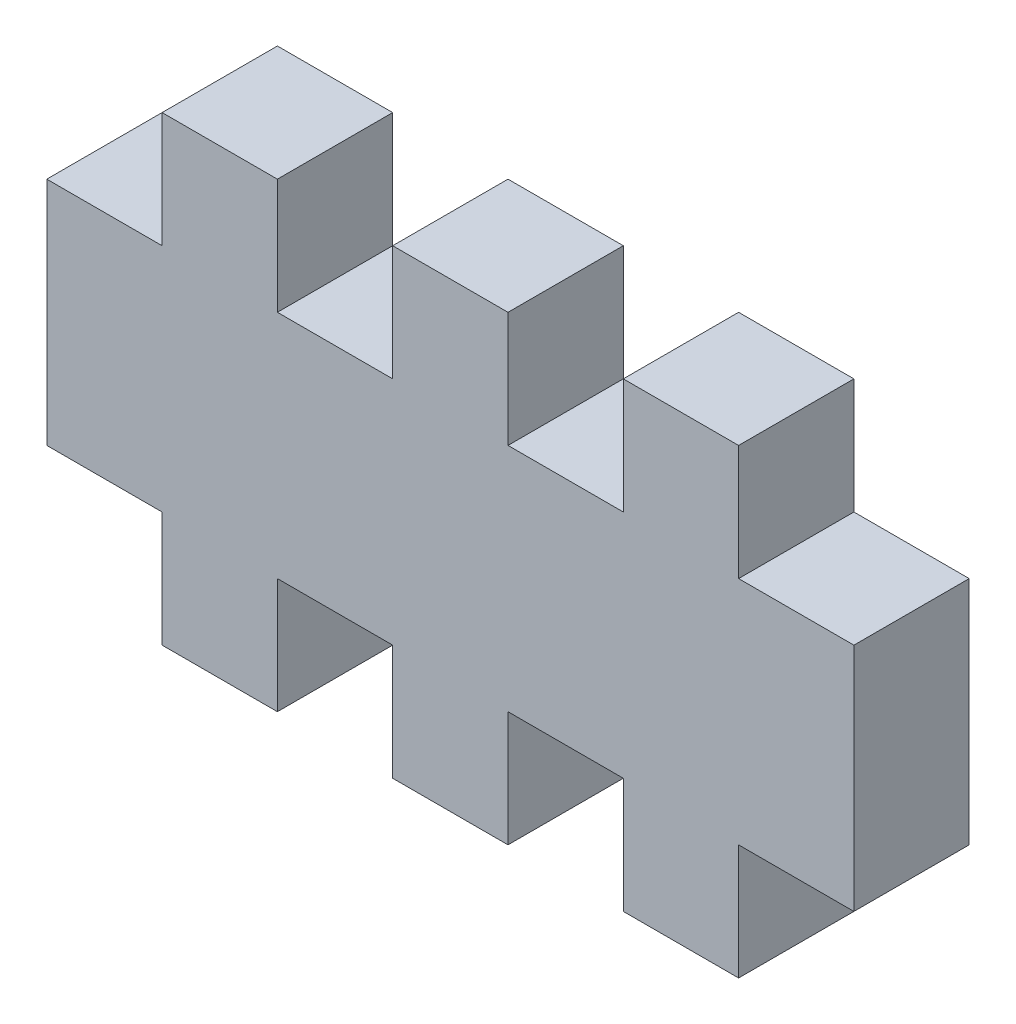
ISO-10303-21;
HEADER;
FILE_DESCRIPTION(('STEP AP214'),'2;1');
FILE_NAME('part.step','',(''),(''),'','','');
FILE_SCHEMA(('AUTOMOTIVE_DESIGN { 1 0 10303 214 1 1 1 1 }'));
ENDSEC;
DATA;
#1=APPLICATION_CONTEXT('core data for automotive mechanical design processes');
#2=APPLICATION_PROTOCOL_DEFINITION('international standard','automotive_design',2000,#1);
#3=PRODUCT_CONTEXT('',#1,'mechanical');
#4=PRODUCT('Part','Part','',(#3));
#5=PRODUCT_RELATED_PRODUCT_CATEGORY('part','',(#4));
#6=PRODUCT_DEFINITION_FORMATION('','',#4);
#7=PRODUCT_DEFINITION_CONTEXT('part definition',#1,'design');
#8=PRODUCT_DEFINITION('design','',#6,#7);
#9=PRODUCT_DEFINITION_SHAPE('','',#8);
#10=(LENGTH_UNIT() NAMED_UNIT(*) SI_UNIT(.MILLI.,.METRE.));
#11=(NAMED_UNIT(*) PLANE_ANGLE_UNIT() SI_UNIT($,.RADIAN.));
#12=(NAMED_UNIT(*) SI_UNIT($,.STERADIAN.) SOLID_ANGLE_UNIT());
#13=UNCERTAINTY_MEASURE_WITH_UNIT(LENGTH_MEASURE(1.E-05),#10,'distance_accuracy_value','');
#14=(GEOMETRIC_REPRESENTATION_CONTEXT(3) GLOBAL_UNCERTAINTY_ASSIGNED_CONTEXT((#13)) GLOBAL_UNIT_ASSIGNED_CONTEXT((#10,
#11,#12)) REPRESENTATION_CONTEXT('',''));
#15=CARTESIAN_POINT('',(0.,0.,0.));
#16=DIRECTION('',(0.,0.,1.));
#17=DIRECTION('',(1.,0.,0.));
#18=AXIS2_PLACEMENT_3D('',#15,#16,#17);
#19=CARTESIAN_POINT('',(6.,0.,3.));
#20=DIRECTION('',(1.,0.,0.));
#21=DIRECTION('',(0.,0.,-1.));
#22=AXIS2_PLACEMENT_3D('',#19,#20,#21);
#23=PLANE('',#22);
#24=DIRECTION('',(0.,-1.,0.));
#25=VECTOR('',#24,1.);
#26=CARTESIAN_POINT('',(6.,0.,0.));
#27=LINE('',#26,#25);
#28=CARTESIAN_POINT('',(6.,0.,0.));
#29=VERTEX_POINT('',#28);
#30=CARTESIAN_POINT('',(6.,-3.00000000000001,0.));
#31=VERTEX_POINT('',#30);
#32=EDGE_CURVE('E251',#29,#31,#27,.T.);
#33=ORIENTED_EDGE('',*,*,#32,.F.);
#34=DIRECTION('',(0.,0.,-1.));
#35=VECTOR('',#34,1.);
#36=CARTESIAN_POINT('',(6.,0.,3.));
#37=LINE('',#36,#35);
#38=CARTESIAN_POINT('',(6.,0.,3.));
#39=VERTEX_POINT('',#38);
#40=EDGE_CURVE('E11',#39,#29,#37,.T.);
#41=ORIENTED_EDGE('',*,*,#40,.F.);
#42=DIRECTION('',(0.,-1.,0.));
#43=VECTOR('',#42,1.);
#44=CARTESIAN_POINT('',(6.,0.,3.));
#45=LINE('',#44,#43);
#46=CARTESIAN_POINT('',(6.,-3.00000000000001,3.));
#47=VERTEX_POINT('',#46);
#48=EDGE_CURVE('E316',#39,#47,#45,.T.);
#49=ORIENTED_EDGE('',*,*,#48,.T.);
#50=DIRECTION('',(0.,0.,-1.));
#51=VECTOR('',#50,1.);
#52=CARTESIAN_POINT('',(6.,-3.00000000000001,3.));
#53=LINE('',#52,#51);
#54=EDGE_CURVE('E146',#47,#31,#53,.T.);
#55=ORIENTED_EDGE('',*,*,#54,.T.);
#56=EDGE_LOOP('',(#33,#41,#49,#55));
#57=FACE_BOUND('',#56,.T.);
#58=ADVANCED_FACE('F35',(#57),#23,.T.);
#59=CARTESIAN_POINT('',(0.,0.,3.));
#60=DIRECTION('',(0.,1.,0.));
#61=DIRECTION('',(0.,0.,1.));
#62=AXIS2_PLACEMENT_3D('',#59,#60,#61);
#63=PLANE('',#62);
#64=DIRECTION('',(1.,0.,0.));
#65=VECTOR('',#64,1.);
#66=CARTESIAN_POINT('',(0.,0.,0.));
#67=LINE('',#66,#65);
#68=CARTESIAN_POINT('',(8.99999999999999,0.,0.));
#69=VERTEX_POINT('',#68);
#70=EDGE_CURVE('E254',#29,#69,#67,.T.);
#71=ORIENTED_EDGE('',*,*,#70,.T.);
#72=DIRECTION('',(0.,0.,-1.));
#73=VECTOR('',#72,1.);
#74=CARTESIAN_POINT('',(8.99999999999999,0.,3.));
#75=LINE('',#74,#73);
#76=CARTESIAN_POINT('',(8.99999999999999,0.,3.));
#77=VERTEX_POINT('',#76);
#78=EDGE_CURVE('E43',#77,#69,#75,.T.);
#79=ORIENTED_EDGE('',*,*,#78,.F.);
#80=DIRECTION('',(1.,0.,0.));
#81=VECTOR('',#80,1.);
#82=CARTESIAN_POINT('',(0.,0.,3.));
#83=LINE('',#82,#81);
#84=EDGE_CURVE('E237',#39,#77,#83,.T.);
#85=ORIENTED_EDGE('',*,*,#84,.F.);
#86=ORIENTED_EDGE('',*,*,#40,.T.);
#87=EDGE_LOOP('',(#71,#79,#85,#86));
#88=FACE_BOUND('',#87,.T.);
#89=ADVANCED_FACE('F492',(#88),#63,.F.);
#90=CARTESIAN_POINT('',(8.99999999999999,0.,3.));
#91=DIRECTION('',(1.,0.,0.));
#92=DIRECTION('',(0.,0.,-1.));
#93=AXIS2_PLACEMENT_3D('',#90,#91,#92);
#94=PLANE('',#93);
#95=DIRECTION('',(0.,-1.,0.));
#96=VECTOR('',#95,1.);
#97=CARTESIAN_POINT('',(8.99999999999999,0.,0.));
#98=LINE('',#97,#96);
#99=CARTESIAN_POINT('',(8.99999999999999,-3.00000000000001,0.));
#100=VERTEX_POINT('',#99);
#101=EDGE_CURVE('E256',#69,#100,#98,.T.);
#102=ORIENTED_EDGE('',*,*,#101,.T.);
#103=DIRECTION('',(0.,0.,-1.));
#104=VECTOR('',#103,1.);
#105=CARTESIAN_POINT('',(8.99999999999999,-3.00000000000001,3.));
#106=LINE('',#105,#104);
#107=CARTESIAN_POINT('',(8.99999999999999,-3.00000000000001,3.));
#108=VERTEX_POINT('',#107);
#109=EDGE_CURVE('E365',#108,#100,#106,.T.);
#110=ORIENTED_EDGE('',*,*,#109,.F.);
#111=DIRECTION('',(0.,-1.,0.));
#112=VECTOR('',#111,1.);
#113=CARTESIAN_POINT('',(8.99999999999999,0.,3.));
#114=LINE('',#113,#112);
#115=EDGE_CURVE('E374',#77,#108,#114,.T.);
#116=ORIENTED_EDGE('',*,*,#115,.F.);
#117=ORIENTED_EDGE('',*,*,#78,.T.);
#118=EDGE_LOOP('',(#102,#110,#116,#117));
#119=FACE_BOUND('',#118,.T.);
#120=ADVANCED_FACE('F372',(#119),#94,.F.);
#121=CARTESIAN_POINT('',(0.,-3.00000000000001,3.));
#122=DIRECTION('',(0.,1.,0.));
#123=DIRECTION('',(0.,0.,1.));
#124=AXIS2_PLACEMENT_3D('',#121,#122,#123);
#125=PLANE('',#124);
#126=DIRECTION('',(1.,0.,0.));
#127=VECTOR('',#126,1.);
#128=CARTESIAN_POINT('',(0.,-3.00000000000001,0.));
#129=LINE('',#128,#127);
#130=CARTESIAN_POINT('',(12.,-3.00000000000001,0.));
#131=VERTEX_POINT('',#130);
#132=EDGE_CURVE('E259',#100,#131,#129,.T.);
#133=ORIENTED_EDGE('',*,*,#132,.T.);
#134=DIRECTION('',(0.,0.,-1.));
#135=VECTOR('',#134,1.);
#136=CARTESIAN_POINT('',(12.,-3.00000000000001,3.));
#137=LINE('',#136,#135);
#138=CARTESIAN_POINT('',(12.,-3.00000000000001,3.));
#139=VERTEX_POINT('',#138);
#140=EDGE_CURVE('E363',#139,#131,#137,.T.);
#141=ORIENTED_EDGE('',*,*,#140,.F.);
#142=DIRECTION('',(1.,0.,0.));
#143=VECTOR('',#142,1.);
#144=CARTESIAN_POINT('',(0.,-3.00000000000001,3.));
#145=LINE('',#144,#143);
#146=EDGE_CURVE('E387',#108,#139,#145,.T.);
#147=ORIENTED_EDGE('',*,*,#146,.F.);
#148=ORIENTED_EDGE('',*,*,#109,.T.);
#149=EDGE_LOOP('',(#133,#141,#147,#148));
#150=FACE_BOUND('',#149,.T.);
#151=ADVANCED_FACE('F384',(#150),#125,.F.);
#152=CARTESIAN_POINT('',(12.,0.,3.));
#153=DIRECTION('',(1.,0.,0.));
#154=DIRECTION('',(0.,0.,-1.));
#155=AXIS2_PLACEMENT_3D('',#152,#153,#154);
#156=PLANE('',#155);
#157=DIRECTION('',(0.,-1.,0.));
#158=VECTOR('',#157,1.);
#159=CARTESIAN_POINT('',(12.,0.,0.));
#160=LINE('',#159,#158);
#161=CARTESIAN_POINT('',(12.,0.,0.));
#162=VERTEX_POINT('',#161);
#163=EDGE_CURVE('E262',#162,#131,#160,.T.);
#164=ORIENTED_EDGE('',*,*,#163,.F.);
#165=DIRECTION('',(0.,0.,-1.));
#166=VECTOR('',#165,1.);
#167=CARTESIAN_POINT('',(12.,0.,3.));
#168=LINE('',#167,#166);
#169=CARTESIAN_POINT('',(12.,0.,3.));
#170=VERTEX_POINT('',#169);
#171=EDGE_CURVE('E361',#170,#162,#168,.T.);
#172=ORIENTED_EDGE('',*,*,#171,.F.);
#173=DIRECTION('',(0.,-1.,0.));
#174=VECTOR('',#173,1.);
#175=CARTESIAN_POINT('',(12.,0.,3.));
#176=LINE('',#175,#174);
#177=EDGE_CURVE('E389',#170,#139,#176,.T.);
#178=ORIENTED_EDGE('',*,*,#177,.T.);
#179=ORIENTED_EDGE('',*,*,#140,.T.);
#180=EDGE_LOOP('',(#164,#172,#178,#179));
#181=FACE_BOUND('',#180,.T.);
#182=ADVANCED_FACE('F540',(#181),#156,.T.);
#183=CARTESIAN_POINT('',(15.,0.,0.));
#184=VERTEX_POINT('',#183);
#185=EDGE_CURVE('E257',#162,#184,#67,.T.);
#186=ORIENTED_EDGE('',*,*,#185,.T.);
#187=DIRECTION('',(0.,0.,-1.));
#188=VECTOR('',#187,1.);
#189=CARTESIAN_POINT('',(15.,0.,3.));
#190=LINE('',#189,#188);
#191=CARTESIAN_POINT('',(15.,0.,3.));
#192=VERTEX_POINT('',#191);
#193=EDGE_CURVE('E358',#192,#184,#190,.T.);
#194=ORIENTED_EDGE('',*,*,#193,.F.);
#195=EDGE_CURVE('E391',#170,#192,#83,.T.);
#196=ORIENTED_EDGE('',*,*,#195,.F.);
#197=ORIENTED_EDGE('',*,*,#171,.T.);
#198=EDGE_LOOP('',(#186,#194,#196,#197));
#199=FACE_BOUND('',#198,.T.);
#200=ADVANCED_FACE('F497',(#199),#63,.F.);
#201=CARTESIAN_POINT('',(15.,0.,3.));
#202=DIRECTION('',(1.,0.,0.));
#203=DIRECTION('',(0.,0.,-1.));
#204=AXIS2_PLACEMENT_3D('',#201,#202,#203);
#205=PLANE('',#204);
#206=DIRECTION('',(0.,-1.,0.));
#207=VECTOR('',#206,1.);
#208=CARTESIAN_POINT('',(15.,0.,0.));
#209=LINE('',#208,#207);
#210=CARTESIAN_POINT('',(15.,-3.00000000000001,0.));
#211=VERTEX_POINT('',#210);
#212=EDGE_CURVE('E265',#184,#211,#209,.T.);
#213=ORIENTED_EDGE('',*,*,#212,.T.);
#214=DIRECTION('',(0.,0.,-1.));
#215=VECTOR('',#214,1.);
#216=CARTESIAN_POINT('',(15.,-3.00000000000001,3.));
#217=LINE('',#216,#215);
#218=CARTESIAN_POINT('',(15.,-3.00000000000001,3.));
#219=VERTEX_POINT('',#218);
#220=EDGE_CURVE('E355',#219,#211,#217,.T.);
#221=ORIENTED_EDGE('',*,*,#220,.F.);
#222=DIRECTION('',(0.,-1.,0.));
#223=VECTOR('',#222,1.);
#224=CARTESIAN_POINT('',(15.,0.,3.));
#225=LINE('',#224,#223);
#226=EDGE_CURVE('E395',#192,#219,#225,.T.);
#227=ORIENTED_EDGE('',*,*,#226,.F.);
#228=ORIENTED_EDGE('',*,*,#193,.T.);
#229=EDGE_LOOP('',(#213,#221,#227,#228));
#230=FACE_BOUND('',#229,.T.);
#231=ADVANCED_FACE('F536',(#230),#205,.F.);
#232=CARTESIAN_POINT('',(0.,-3.00000000000001,3.));
#233=DIRECTION('',(0.,1.,0.));
#234=DIRECTION('',(0.,0.,1.));
#235=AXIS2_PLACEMENT_3D('',#232,#233,#234);
#236=PLANE('',#235);
#237=DIRECTION('',(1.,0.,0.));
#238=VECTOR('',#237,1.);
#239=CARTESIAN_POINT('',(0.,-3.00000000000001,0.));
#240=LINE('',#239,#238);
#241=CARTESIAN_POINT('',(18.,-3.00000000000001,0.));
#242=VERTEX_POINT('',#241);
#243=EDGE_CURVE('E267',#211,#242,#240,.T.);
#244=ORIENTED_EDGE('',*,*,#243,.T.);
#245=DIRECTION('',(0.,0.,-1.));
#246=VECTOR('',#245,1.);
#247=CARTESIAN_POINT('',(18.,-3.00000000000001,3.));
#248=LINE('',#247,#246);
#249=CARTESIAN_POINT('',(18.,-3.00000000000001,3.));
#250=VERTEX_POINT('',#249);
#251=EDGE_CURVE('E353',#250,#242,#248,.T.);
#252=ORIENTED_EDGE('',*,*,#251,.F.);
#253=DIRECTION('',(1.,0.,0.));
#254=VECTOR('',#253,1.);
#255=CARTESIAN_POINT('',(0.,-3.00000000000001,3.));
#256=LINE('',#255,#254);
#257=EDGE_CURVE('E397',#219,#250,#256,.T.);
#258=ORIENTED_EDGE('',*,*,#257,.F.);
#259=ORIENTED_EDGE('',*,*,#220,.T.);
#260=EDGE_LOOP('',(#244,#252,#258,#259));
#261=FACE_BOUND('',#260,.T.);
#262=ADVANCED_FACE('F532',(#261),#236,.F.);
#263=CARTESIAN_POINT('',(18.,0.,3.));
#264=DIRECTION('',(1.,0.,0.));
#265=DIRECTION('',(0.,0.,-1.));
#266=AXIS2_PLACEMENT_3D('',#263,#264,#265);
#267=PLANE('',#266);
#268=DIRECTION('',(0.,-1.,0.));
#269=VECTOR('',#268,1.);
#270=CARTESIAN_POINT('',(18.,0.,0.));
#271=LINE('',#270,#269);
#272=CARTESIAN_POINT('',(18.,0.,0.));
#273=VERTEX_POINT('',#272);
#274=EDGE_CURVE('E270',#273,#242,#271,.T.);
#275=ORIENTED_EDGE('',*,*,#274,.F.);
#276=DIRECTION('',(0.,0.,-1.));
#277=VECTOR('',#276,1.);
#278=CARTESIAN_POINT('',(18.,0.,3.));
#279=LINE('',#278,#277);
#280=CARTESIAN_POINT('',(18.,0.,3.));
#281=VERTEX_POINT('',#280);
#282=EDGE_CURVE('E351',#281,#273,#279,.T.);
#283=ORIENTED_EDGE('',*,*,#282,.F.);
#284=DIRECTION('',(0.,-1.,0.));
#285=VECTOR('',#284,1.);
#286=CARTESIAN_POINT('',(18.,0.,3.));
#287=LINE('',#286,#285);
#288=EDGE_CURVE('E399',#281,#250,#287,.T.);
#289=ORIENTED_EDGE('',*,*,#288,.T.);
#290=ORIENTED_EDGE('',*,*,#251,.T.);
#291=EDGE_LOOP('',(#275,#283,#289,#290));
#292=FACE_BOUND('',#291,.T.);
#293=ADVANCED_FACE('F528',(#292),#267,.T.);
#294=CARTESIAN_POINT('',(21.,0.,0.));
#295=VERTEX_POINT('',#294);
#296=EDGE_CURVE('E273',#273,#295,#67,.T.);
#297=ORIENTED_EDGE('',*,*,#296,.T.);
#298=DIRECTION('',(0.,0.,-1.));
#299=VECTOR('',#298,1.);
#300=CARTESIAN_POINT('',(21.,0.,3.));
#301=LINE('',#300,#299);
#302=CARTESIAN_POINT('',(21.,0.,3.));
#303=VERTEX_POINT('',#302);
#304=EDGE_CURVE('E348',#303,#295,#301,.T.);
#305=ORIENTED_EDGE('',*,*,#304,.F.);
#306=EDGE_CURVE('E236',#281,#303,#83,.T.);
#307=ORIENTED_EDGE('',*,*,#306,.F.);
#308=ORIENTED_EDGE('',*,*,#282,.T.);
#309=EDGE_LOOP('',(#297,#305,#307,#308));
#310=FACE_BOUND('',#309,.T.);
#311=ADVANCED_FACE('F511',(#310),#63,.F.);
#312=CARTESIAN_POINT('',(21.,0.,3.));
#313=DIRECTION('',(-1.,0.,0.));
#314=DIRECTION('',(0.,0.,1.));
#315=AXIS2_PLACEMENT_3D('',#312,#313,#314);
#316=PLANE('',#315);
#317=DIRECTION('',(0.,1.,0.));
#318=VECTOR('',#317,1.);
#319=CARTESIAN_POINT('',(21.,0.,0.));
#320=LINE('',#319,#318);
#321=CARTESIAN_POINT('',(21.,6.,0.));
#322=VERTEX_POINT('',#321);
#323=EDGE_CURVE('E274',#295,#322,#320,.T.);
#324=ORIENTED_EDGE('',*,*,#323,.T.);
#325=DIRECTION('',(0.,0.,-1.));
#326=VECTOR('',#325,1.);
#327=CARTESIAN_POINT('',(21.,6.,3.));
#328=LINE('',#327,#326);
#329=CARTESIAN_POINT('',(21.,6.,3.));
#330=VERTEX_POINT('',#329);
#331=EDGE_CURVE('E346',#330,#322,#328,.T.);
#332=ORIENTED_EDGE('',*,*,#331,.F.);
#333=DIRECTION('',(0.,1.,0.));
#334=VECTOR('',#333,1.);
#335=CARTESIAN_POINT('',(21.,0.,3.));
#336=LINE('',#335,#334);
#337=EDGE_CURVE('E402',#303,#330,#336,.T.);
#338=ORIENTED_EDGE('',*,*,#337,.F.);
#339=ORIENTED_EDGE('',*,*,#304,.T.);
#340=EDGE_LOOP('',(#324,#332,#338,#339));
#341=FACE_BOUND('',#340,.T.);
#342=ADVANCED_FACE('F515',(#341),#316,.F.);
#343=CARTESIAN_POINT('',(0.,6.,3.));
#344=DIRECTION('',(0.,1.,0.));
#345=DIRECTION('',(0.,0.,1.));
#346=AXIS2_PLACEMENT_3D('',#343,#344,#345);
#347=PLANE('',#346);
#348=DIRECTION('',(1.,0.,0.));
#349=VECTOR('',#348,1.);
#350=CARTESIAN_POINT('',(0.,6.,0.));
#351=LINE('',#350,#349);
#352=CARTESIAN_POINT('',(18.,6.,0.));
#353=VERTEX_POINT('',#352);
#354=EDGE_CURVE('E277',#353,#322,#351,.T.);
#355=ORIENTED_EDGE('',*,*,#354,.F.);
#356=DIRECTION('',(0.,0.,-1.));
#357=VECTOR('',#356,1.);
#358=CARTESIAN_POINT('',(18.,6.,3.));
#359=LINE('',#358,#357);
#360=CARTESIAN_POINT('',(18.,6.,3.));
#361=VERTEX_POINT('',#360);
#362=EDGE_CURVE('E344',#361,#353,#359,.T.);
#363=ORIENTED_EDGE('',*,*,#362,.F.);
#364=DIRECTION('',(1.,0.,0.));
#365=VECTOR('',#364,1.);
#366=CARTESIAN_POINT('',(0.,6.,3.));
#367=LINE('',#366,#365);
#368=EDGE_CURVE('E404',#361,#330,#367,.T.);
#369=ORIENTED_EDGE('',*,*,#368,.T.);
#370=ORIENTED_EDGE('',*,*,#331,.T.);
#371=EDGE_LOOP('',(#355,#363,#369,#370));
#372=FACE_BOUND('',#371,.T.);
#373=ADVANCED_FACE('F489',(#372),#347,.T.);
#374=CARTESIAN_POINT('',(18.,0.,3.));
#375=DIRECTION('',(-1.,0.,0.));
#376=DIRECTION('',(0.,0.,1.));
#377=AXIS2_PLACEMENT_3D('',#374,#375,#376);
#378=PLANE('',#377);
#379=DIRECTION('',(0.,1.,0.));
#380=VECTOR('',#379,1.);
#381=CARTESIAN_POINT('',(18.,0.,0.));
#382=LINE('',#381,#380);
#383=CARTESIAN_POINT('',(18.,9.,0.));
#384=VERTEX_POINT('',#383);
#385=EDGE_CURVE('E280',#353,#384,#382,.T.);
#386=ORIENTED_EDGE('',*,*,#385,.T.);
#387=DIRECTION('',(0.,0.,-1.));
#388=VECTOR('',#387,1.);
#389=CARTESIAN_POINT('',(18.,9.,3.));
#390=LINE('',#389,#388);
#391=CARTESIAN_POINT('',(18.,9.,3.));
#392=VERTEX_POINT('',#391);
#393=EDGE_CURVE('E342',#392,#384,#390,.T.);
#394=ORIENTED_EDGE('',*,*,#393,.F.);
#395=DIRECTION('',(0.,1.,0.));
#396=VECTOR('',#395,1.);
#397=CARTESIAN_POINT('',(18.,0.,3.));
#398=LINE('',#397,#396);
#399=EDGE_CURVE('E407',#361,#392,#398,.T.);
#400=ORIENTED_EDGE('',*,*,#399,.F.);
#401=ORIENTED_EDGE('',*,*,#362,.T.);
#402=EDGE_LOOP('',(#386,#394,#400,#401));
#403=FACE_BOUND('',#402,.T.);
#404=ADVANCED_FACE('F521',(#403),#378,.F.);
#405=CARTESIAN_POINT('',(0.,9.,3.));
#406=DIRECTION('',(0.,1.,0.));
#407=DIRECTION('',(0.,0.,1.));
#408=AXIS2_PLACEMENT_3D('',#405,#406,#407);
#409=PLANE('',#408);
#410=DIRECTION('',(1.,0.,0.));
#411=VECTOR('',#410,1.);
#412=CARTESIAN_POINT('',(0.,9.,0.));
#413=LINE('',#412,#411);
#414=CARTESIAN_POINT('',(15.,9.,0.));
#415=VERTEX_POINT('',#414);
#416=EDGE_CURVE('E285',#415,#384,#413,.T.);
#417=ORIENTED_EDGE('',*,*,#416,.F.);
#418=DIRECTION('',(0.,0.,-1.));
#419=VECTOR('',#418,1.);
#420=CARTESIAN_POINT('',(15.,9.,3.));
#421=LINE('',#420,#419);
#422=CARTESIAN_POINT('',(15.,9.,3.));
#423=VERTEX_POINT('',#422);
#424=EDGE_CURVE('E340',#423,#415,#421,.T.);
#425=ORIENTED_EDGE('',*,*,#424,.F.);
#426=DIRECTION('',(1.,0.,0.));
#427=VECTOR('',#426,1.);
#428=CARTESIAN_POINT('',(0.,9.,3.));
#429=LINE('',#428,#427);
#430=EDGE_CURVE('E411',#423,#392,#429,.T.);
#431=ORIENTED_EDGE('',*,*,#430,.T.);
#432=ORIENTED_EDGE('',*,*,#393,.T.);
#433=EDGE_LOOP('',(#417,#425,#431,#432));
#434=FACE_BOUND('',#433,.T.);
#435=ADVANCED_FACE('F524',(#434),#409,.T.);
#436=CARTESIAN_POINT('',(15.,0.,3.));
#437=DIRECTION('',(-1.,0.,0.));
#438=DIRECTION('',(0.,0.,1.));
#439=AXIS2_PLACEMENT_3D('',#436,#437,#438);
#440=PLANE('',#439);
#441=DIRECTION('',(0.,1.,0.));
#442=VECTOR('',#441,1.);
#443=CARTESIAN_POINT('',(15.,0.,0.));
#444=LINE('',#443,#442);
#445=CARTESIAN_POINT('',(15.,6.,0.));
#446=VERTEX_POINT('',#445);
#447=EDGE_CURVE('E288',#446,#415,#444,.T.);
#448=ORIENTED_EDGE('',*,*,#447,.F.);
#449=DIRECTION('',(0.,0.,-1.));
#450=VECTOR('',#449,1.);
#451=CARTESIAN_POINT('',(15.,6.,3.));
#452=LINE('',#451,#450);
#453=CARTESIAN_POINT('',(15.,6.,3.));
#454=VERTEX_POINT('',#453);
#455=EDGE_CURVE('E338',#454,#446,#452,.T.);
#456=ORIENTED_EDGE('',*,*,#455,.F.);
#457=DIRECTION('',(0.,1.,0.));
#458=VECTOR('',#457,1.);
#459=CARTESIAN_POINT('',(15.,0.,3.));
#460=LINE('',#459,#458);
#461=EDGE_CURVE('E414',#454,#423,#460,.T.);
#462=ORIENTED_EDGE('',*,*,#461,.T.);
#463=ORIENTED_EDGE('',*,*,#424,.T.);
#464=EDGE_LOOP('',(#448,#456,#462,#463));
#465=FACE_BOUND('',#464,.T.);
#466=ADVANCED_FACE('F451',(#465),#440,.T.);
#467=CARTESIAN_POINT('',(12.,6.,0.));
#468=VERTEX_POINT('',#467);
#469=EDGE_CURVE('E282',#468,#446,#351,.T.);
#470=ORIENTED_EDGE('',*,*,#469,.F.);
#471=DIRECTION('',(0.,0.,-1.));
#472=VECTOR('',#471,1.);
#473=CARTESIAN_POINT('',(12.,6.,3.));
#474=LINE('',#473,#472);
#475=CARTESIAN_POINT('',(12.,6.,3.));
#476=VERTEX_POINT('',#475);
#477=EDGE_CURVE('E336',#476,#468,#474,.T.);
#478=ORIENTED_EDGE('',*,*,#477,.F.);
#479=EDGE_CURVE('E409',#476,#454,#367,.T.);
#480=ORIENTED_EDGE('',*,*,#479,.T.);
#481=ORIENTED_EDGE('',*,*,#455,.T.);
#482=EDGE_LOOP('',(#470,#478,#480,#481));
#483=FACE_BOUND('',#482,.T.);
#484=ADVANCED_FACE('F443',(#483),#347,.T.);
#485=CARTESIAN_POINT('',(12.,0.,3.));
#486=DIRECTION('',(-1.,0.,0.));
#487=DIRECTION('',(0.,0.,1.));
#488=AXIS2_PLACEMENT_3D('',#485,#486,#487);
#489=PLANE('',#488);
#490=DIRECTION('',(0.,1.,0.));
#491=VECTOR('',#490,1.);
#492=CARTESIAN_POINT('',(12.,0.,0.));
#493=LINE('',#492,#491);
#494=CARTESIAN_POINT('',(12.,9.,0.));
#495=VERTEX_POINT('',#494);
#496=EDGE_CURVE('E291',#468,#495,#493,.T.);
#497=ORIENTED_EDGE('',*,*,#496,.T.);
#498=DIRECTION('',(0.,0.,-1.));
#499=VECTOR('',#498,1.);
#500=CARTESIAN_POINT('',(12.,9.,3.));
#501=LINE('',#500,#499);
#502=CARTESIAN_POINT('',(12.,9.,3.));
#503=VERTEX_POINT('',#502);
#504=EDGE_CURVE('E334',#503,#495,#501,.T.);
#505=ORIENTED_EDGE('',*,*,#504,.F.);
#506=DIRECTION('',(0.,1.,0.));
#507=VECTOR('',#506,1.);
#508=CARTESIAN_POINT('',(12.,0.,3.));
#509=LINE('',#508,#507);
#510=EDGE_CURVE('E417',#476,#503,#509,.T.);
#511=ORIENTED_EDGE('',*,*,#510,.F.);
#512=ORIENTED_EDGE('',*,*,#477,.T.);
#513=EDGE_LOOP('',(#497,#505,#511,#512));
#514=FACE_BOUND('',#513,.T.);
#515=ADVANCED_FACE('F480',(#514),#489,.F.);
#516=CARTESIAN_POINT('',(0.,9.,3.));
#517=DIRECTION('',(0.,1.,0.));
#518=DIRECTION('',(0.,0.,1.));
#519=AXIS2_PLACEMENT_3D('',#516,#517,#518);
#520=PLANE('',#519);
#521=DIRECTION('',(1.,0.,0.));
#522=VECTOR('',#521,1.);
#523=CARTESIAN_POINT('',(0.,9.,0.));
#524=LINE('',#523,#522);
#525=CARTESIAN_POINT('',(9.,9.,0.));
#526=VERTEX_POINT('',#525);
#527=EDGE_CURVE('E294',#526,#495,#524,.T.);
#528=ORIENTED_EDGE('',*,*,#527,.F.);
#529=DIRECTION('',(0.,0.,-1.));
#530=VECTOR('',#529,1.);
#531=CARTESIAN_POINT('',(9.,9.,3.));
#532=LINE('',#531,#530);
#533=CARTESIAN_POINT('',(9.,9.,3.));
#534=VERTEX_POINT('',#533);
#535=EDGE_CURVE('E332',#534,#526,#532,.T.);
#536=ORIENTED_EDGE('',*,*,#535,.F.);
#537=DIRECTION('',(1.,0.,0.));
#538=VECTOR('',#537,1.);
#539=CARTESIAN_POINT('',(0.,9.,3.));
#540=LINE('',#539,#538);
#541=EDGE_CURVE('E419',#534,#503,#540,.T.);
#542=ORIENTED_EDGE('',*,*,#541,.T.);
#543=ORIENTED_EDGE('',*,*,#504,.T.);
#544=EDGE_LOOP('',(#528,#536,#542,#543));
#545=FACE_BOUND('',#544,.T.);
#546=ADVANCED_FACE('F478',(#545),#520,.T.);
#547=CARTESIAN_POINT('',(9.,0.,3.));
#548=DIRECTION('',(-1.,0.,0.));
#549=DIRECTION('',(0.,0.,1.));
#550=AXIS2_PLACEMENT_3D('',#547,#548,#549);
#551=PLANE('',#550);
#552=DIRECTION('',(0.,1.,0.));
#553=VECTOR('',#552,1.);
#554=CARTESIAN_POINT('',(9.,0.,0.));
#555=LINE('',#554,#553);
#556=CARTESIAN_POINT('',(9.,6.,0.));
#557=VERTEX_POINT('',#556);
#558=EDGE_CURVE('E297',#557,#526,#555,.T.);
#559=ORIENTED_EDGE('',*,*,#558,.F.);
#560=DIRECTION('',(0.,0.,-1.));
#561=VECTOR('',#560,1.);
#562=CARTESIAN_POINT('',(9.,6.,3.));
#563=LINE('',#562,#561);
#564=CARTESIAN_POINT('',(9.,6.,3.));
#565=VERTEX_POINT('',#564);
#566=EDGE_CURVE('E330',#565,#557,#563,.T.);
#567=ORIENTED_EDGE('',*,*,#566,.F.);
#568=DIRECTION('',(0.,1.,0.));
#569=VECTOR('',#568,1.);
#570=CARTESIAN_POINT('',(9.,0.,3.));
#571=LINE('',#570,#569);
#572=EDGE_CURVE('E422',#565,#534,#571,.T.);
#573=ORIENTED_EDGE('',*,*,#572,.T.);
#574=ORIENTED_EDGE('',*,*,#535,.T.);
#575=EDGE_LOOP('',(#559,#567,#573,#574));
#576=FACE_BOUND('',#575,.T.);
#577=ADVANCED_FACE('F475',(#576),#551,.T.);
#578=CARTESIAN_POINT('',(6.,6.,0.));
#579=VERTEX_POINT('',#578);
#580=EDGE_CURVE('E300',#579,#557,#351,.T.);
#581=ORIENTED_EDGE('',*,*,#580,.F.);
#582=DIRECTION('',(0.,0.,-1.));
#583=VECTOR('',#582,1.);
#584=CARTESIAN_POINT('',(6.,6.,3.));
#585=LINE('',#584,#583);
#586=CARTESIAN_POINT('',(6.,6.,3.));
#587=VERTEX_POINT('',#586);
#588=EDGE_CURVE('E328',#587,#579,#585,.T.);
#589=ORIENTED_EDGE('',*,*,#588,.F.);
#590=EDGE_CURVE('E425',#587,#565,#367,.T.);
#591=ORIENTED_EDGE('',*,*,#590,.T.);
#592=ORIENTED_EDGE('',*,*,#566,.T.);
#593=EDGE_LOOP('',(#581,#589,#591,#592));
#594=FACE_BOUND('',#593,.T.);
#595=ADVANCED_FACE('F470',(#594),#347,.T.);
#596=CARTESIAN_POINT('',(6.,0.,3.));
#597=DIRECTION('',(-1.,0.,0.));
#598=DIRECTION('',(0.,0.,1.));
#599=AXIS2_PLACEMENT_3D('',#596,#597,#598);
#600=PLANE('',#599);
#601=DIRECTION('',(0.,1.,0.));
#602=VECTOR('',#601,1.);
#603=CARTESIAN_POINT('',(6.,0.,0.));
#604=LINE('',#603,#602);
#605=CARTESIAN_POINT('',(6.,9.,0.));
#606=VERTEX_POINT('',#605);
#607=EDGE_CURVE('E301',#579,#606,#604,.T.);
#608=ORIENTED_EDGE('',*,*,#607,.T.);
#609=DIRECTION('',(0.,0.,-1.));
#610=VECTOR('',#609,1.);
#611=CARTESIAN_POINT('',(6.,9.,3.));
#612=LINE('',#611,#610);
#613=CARTESIAN_POINT('',(6.,9.,3.));
#614=VERTEX_POINT('',#613);
#615=EDGE_CURVE('E326',#614,#606,#612,.T.);
#616=ORIENTED_EDGE('',*,*,#615,.F.);
#617=DIRECTION('',(0.,1.,0.));
#618=VECTOR('',#617,1.);
#619=CARTESIAN_POINT('',(6.,0.,3.));
#620=LINE('',#619,#618);
#621=EDGE_CURVE('E426',#587,#614,#620,.T.);
#622=ORIENTED_EDGE('',*,*,#621,.F.);
#623=ORIENTED_EDGE('',*,*,#588,.T.);
#624=EDGE_LOOP('',(#608,#616,#622,#623));
#625=FACE_BOUND('',#624,.T.);
#626=ADVANCED_FACE('F672',(#625),#600,.F.);
#627=CARTESIAN_POINT('',(0.,9.,3.));
#628=DIRECTION('',(0.,1.,0.));
#629=DIRECTION('',(0.,0.,1.));
#630=AXIS2_PLACEMENT_3D('',#627,#628,#629);
#631=PLANE('',#630);
#632=DIRECTION('',(1.,0.,0.));
#633=VECTOR('',#632,1.);
#634=CARTESIAN_POINT('',(0.,9.,0.));
#635=LINE('',#634,#633);
#636=CARTESIAN_POINT('',(3.,9.,0.));
#637=VERTEX_POINT('',#636);
#638=EDGE_CURVE('E304',#637,#606,#635,.T.);
#639=ORIENTED_EDGE('',*,*,#638,.F.);
#640=DIRECTION('',(0.,0.,-1.));
#641=VECTOR('',#640,1.);
#642=CARTESIAN_POINT('',(3.,9.,3.));
#643=LINE('',#642,#641);
#644=CARTESIAN_POINT('',(3.,9.,3.));
#645=VERTEX_POINT('',#644);
#646=EDGE_CURVE('E324',#645,#637,#643,.T.);
#647=ORIENTED_EDGE('',*,*,#646,.F.);
#648=DIRECTION('',(1.,0.,0.));
#649=VECTOR('',#648,1.);
#650=CARTESIAN_POINT('',(0.,9.,3.));
#651=LINE('',#650,#649);
#652=EDGE_CURVE('E428',#645,#614,#651,.T.);
#653=ORIENTED_EDGE('',*,*,#652,.T.);
#654=ORIENTED_EDGE('',*,*,#615,.T.);
#655=EDGE_LOOP('',(#639,#647,#653,#654));
#656=FACE_BOUND('',#655,.T.);
#657=ADVANCED_FACE('F467',(#656),#631,.T.);
#658=CARTESIAN_POINT('',(3.,0.,3.));
#659=DIRECTION('',(-1.,0.,0.));
#660=DIRECTION('',(0.,0.,1.));
#661=AXIS2_PLACEMENT_3D('',#658,#659,#660);
#662=PLANE('',#661);
#663=DIRECTION('',(0.,1.,0.));
#664=VECTOR('',#663,1.);
#665=CARTESIAN_POINT('',(3.,0.,0.));
#666=LINE('',#665,#664);
#667=CARTESIAN_POINT('',(3.,6.,0.));
#668=VERTEX_POINT('',#667);
#669=EDGE_CURVE('E307',#668,#637,#666,.T.);
#670=ORIENTED_EDGE('',*,*,#669,.F.);
#671=DIRECTION('',(0.,0.,-1.));
#672=VECTOR('',#671,1.);
#673=CARTESIAN_POINT('',(3.,6.,3.));
#674=LINE('',#673,#672);
#675=CARTESIAN_POINT('',(3.,6.,3.));
#676=VERTEX_POINT('',#675);
#677=EDGE_CURVE('E322',#676,#668,#674,.T.);
#678=ORIENTED_EDGE('',*,*,#677,.F.);
#679=DIRECTION('',(0.,1.,0.));
#680=VECTOR('',#679,1.);
#681=CARTESIAN_POINT('',(3.,0.,3.));
#682=LINE('',#681,#680);
#683=EDGE_CURVE('E430',#676,#645,#682,.T.);
#684=ORIENTED_EDGE('',*,*,#683,.T.);
#685=ORIENTED_EDGE('',*,*,#646,.T.);
#686=EDGE_LOOP('',(#670,#678,#684,#685));
#687=FACE_BOUND('',#686,.T.);
#688=ADVANCED_FACE('F463',(#687),#662,.T.);
#689=CARTESIAN_POINT('',(0.,6.,0.));
#690=VERTEX_POINT('',#689);
#691=EDGE_CURVE('E281',#690,#668,#351,.T.);
#692=ORIENTED_EDGE('',*,*,#691,.F.);
#693=DIRECTION('',(0.,0.,-1.));
#694=VECTOR('',#693,1.);
#695=CARTESIAN_POINT('',(0.,6.,3.));
#696=LINE('',#695,#694);
#697=CARTESIAN_POINT('',(0.,6.,3.));
#698=VERTEX_POINT('',#697);
#699=EDGE_CURVE('E320',#698,#690,#696,.T.);
#700=ORIENTED_EDGE('',*,*,#699,.F.);
#701=EDGE_CURVE('E408',#698,#676,#367,.T.);
#702=ORIENTED_EDGE('',*,*,#701,.T.);
#703=ORIENTED_EDGE('',*,*,#677,.T.);
#704=EDGE_LOOP('',(#692,#700,#702,#703));
#705=FACE_BOUND('',#704,.T.);
#706=ADVANCED_FACE('F462',(#705),#347,.T.);
#707=CARTESIAN_POINT('',(0.,0.,3.));
#708=DIRECTION('',(-1.,0.,0.));
#709=DIRECTION('',(0.,0.,1.));
#710=AXIS2_PLACEMENT_3D('',#707,#708,#709);
#711=PLANE('',#710);
#712=DIRECTION('',(0.,1.,0.));
#713=VECTOR('',#712,1.);
#714=CARTESIAN_POINT('',(0.,0.,0.));
#715=LINE('',#714,#713);
#716=CARTESIAN_POINT('',(0.,0.,0.));
#717=VERTEX_POINT('',#716);
#718=EDGE_CURVE('E310',#717,#690,#715,.T.);
#719=ORIENTED_EDGE('',*,*,#718,.F.);
#720=DIRECTION('',(0.,0.,-1.));
#721=VECTOR('',#720,1.);
#722=CARTESIAN_POINT('',(0.,0.,3.));
#723=LINE('',#722,#721);
#724=CARTESIAN_POINT('',(0.,0.,3.));
#725=VERTEX_POINT('',#724);
#726=EDGE_CURVE('E242',#725,#717,#723,.T.);
#727=ORIENTED_EDGE('',*,*,#726,.F.);
#728=DIRECTION('',(0.,1.,0.));
#729=VECTOR('',#728,1.);
#730=CARTESIAN_POINT('',(0.,0.,3.));
#731=LINE('',#730,#729);
#732=EDGE_CURVE('E233',#725,#698,#731,.T.);
#733=ORIENTED_EDGE('',*,*,#732,.T.);
#734=ORIENTED_EDGE('',*,*,#699,.T.);
#735=EDGE_LOOP('',(#719,#727,#733,#734));
#736=FACE_BOUND('',#735,.T.);
#737=ADVANCED_FACE('F705',(#736),#711,.T.);
#738=CARTESIAN_POINT('',(3.,0.,0.));
#739=VERTEX_POINT('',#738);
#740=EDGE_CURVE('E241',#717,#739,#67,.T.);
#741=ORIENTED_EDGE('',*,*,#740,.T.);
#742=DIRECTION('',(0.,0.,-1.));
#743=VECTOR('',#742,1.);
#744=CARTESIAN_POINT('',(3.,0.,3.));
#745=LINE('',#744,#743);
#746=CARTESIAN_POINT('',(3.,0.,3.));
#747=VERTEX_POINT('',#746);
#748=EDGE_CURVE('E238',#747,#739,#745,.T.);
#749=ORIENTED_EDGE('',*,*,#748,.F.);
#750=EDGE_CURVE('E226',#725,#747,#83,.T.);
#751=ORIENTED_EDGE('',*,*,#750,.F.);
#752=ORIENTED_EDGE('',*,*,#726,.T.);
#753=EDGE_LOOP('',(#741,#749,#751,#752));
#754=FACE_BOUND('',#753,.T.);
#755=ADVANCED_FACE('F239',(#754),#63,.F.);
#756=CARTESIAN_POINT('',(3.,0.,3.));
#757=DIRECTION('',(1.,0.,0.));
#758=DIRECTION('',(0.,0.,-1.));
#759=AXIS2_PLACEMENT_3D('',#756,#757,#758);
#760=PLANE('',#759);
#761=DIRECTION('',(0.,-1.,0.));
#762=VECTOR('',#761,1.);
#763=CARTESIAN_POINT('',(3.,0.,0.));
#764=LINE('',#763,#762);
#765=CARTESIAN_POINT('',(3.,-3.00000000000001,0.));
#766=VERTEX_POINT('',#765);
#767=EDGE_CURVE('E139',#739,#766,#764,.T.);
#768=ORIENTED_EDGE('',*,*,#767,.T.);
#769=DIRECTION('',(0.,0.,-1.));
#770=VECTOR('',#769,1.);
#771=CARTESIAN_POINT('',(3.,-3.00000000000001,3.));
#772=LINE('',#771,#770);
#773=CARTESIAN_POINT('',(3.,-3.00000000000001,3.));
#774=VERTEX_POINT('',#773);
#775=EDGE_CURVE('E243',#774,#766,#772,.T.);
#776=ORIENTED_EDGE('',*,*,#775,.F.);
#777=DIRECTION('',(0.,-1.,0.));
#778=VECTOR('',#777,1.);
#779=CARTESIAN_POINT('',(3.,0.,3.));
#780=LINE('',#779,#778);
#781=EDGE_CURVE('E230',#747,#774,#780,.T.);
#782=ORIENTED_EDGE('',*,*,#781,.F.);
#783=ORIENTED_EDGE('',*,*,#748,.T.);
#784=EDGE_LOOP('',(#768,#776,#782,#783));
#785=FACE_BOUND('',#784,.T.);
#786=ADVANCED_FACE('F245',(#785),#760,.F.);
#787=CARTESIAN_POINT('',(0.,-3.00000000000001,3.));
#788=DIRECTION('',(0.,1.,0.));
#789=DIRECTION('',(0.,0.,1.));
#790=AXIS2_PLACEMENT_3D('',#787,#788,#789);
#791=PLANE('',#790);
#792=DIRECTION('',(1.,0.,0.));
#793=VECTOR('',#792,1.);
#794=CARTESIAN_POINT('',(0.,-3.00000000000001,0.));
#795=LINE('',#794,#793);
#796=EDGE_CURVE('E314',#766,#31,#795,.T.);
#797=ORIENTED_EDGE('',*,*,#796,.T.);
#798=ORIENTED_EDGE('',*,*,#54,.F.);
#799=DIRECTION('',(1.,0.,0.));
#800=VECTOR('',#799,1.);
#801=CARTESIAN_POINT('',(0.,-3.00000000000001,3.));
#802=LINE('',#801,#800);
#803=EDGE_CURVE('E51',#774,#47,#802,.T.);
#804=ORIENTED_EDGE('',*,*,#803,.F.);
#805=ORIENTED_EDGE('',*,*,#775,.T.);
#806=EDGE_LOOP('',(#797,#798,#804,#805));
#807=FACE_BOUND('',#806,.T.);
#808=ADVANCED_FACE('F500',(#807),#791,.F.);
#809=CARTESIAN_POINT('',(0.,0.,3.));
#810=DIRECTION('',(0.,0.,1.));
#811=DIRECTION('',(1.,0.,0.));
#812=AXIS2_PLACEMENT_3D('',#809,#810,#811);
#813=PLANE('',#812);
#814=ORIENTED_EDGE('',*,*,#48,.F.);
#815=ORIENTED_EDGE('',*,*,#84,.T.);
#816=ORIENTED_EDGE('',*,*,#115,.T.);
#817=ORIENTED_EDGE('',*,*,#146,.T.);
#818=ORIENTED_EDGE('',*,*,#177,.F.);
#819=ORIENTED_EDGE('',*,*,#195,.T.);
#820=ORIENTED_EDGE('',*,*,#226,.T.);
#821=ORIENTED_EDGE('',*,*,#257,.T.);
#822=ORIENTED_EDGE('',*,*,#288,.F.);
#823=ORIENTED_EDGE('',*,*,#306,.T.);
#824=ORIENTED_EDGE('',*,*,#337,.T.);
#825=ORIENTED_EDGE('',*,*,#368,.F.);
#826=ORIENTED_EDGE('',*,*,#399,.T.);
#827=ORIENTED_EDGE('',*,*,#430,.F.);
#828=ORIENTED_EDGE('',*,*,#461,.F.);
#829=ORIENTED_EDGE('',*,*,#479,.F.);
#830=ORIENTED_EDGE('',*,*,#510,.T.);
#831=ORIENTED_EDGE('',*,*,#541,.F.);
#832=ORIENTED_EDGE('',*,*,#572,.F.);
#833=ORIENTED_EDGE('',*,*,#590,.F.);
#834=ORIENTED_EDGE('',*,*,#621,.T.);
#835=ORIENTED_EDGE('',*,*,#652,.F.);
#836=ORIENTED_EDGE('',*,*,#683,.F.);
#837=ORIENTED_EDGE('',*,*,#701,.F.);
#838=ORIENTED_EDGE('',*,*,#732,.F.);
#839=ORIENTED_EDGE('',*,*,#750,.T.);
#840=ORIENTED_EDGE('',*,*,#781,.T.);
#841=ORIENTED_EDGE('',*,*,#803,.T.);
#842=EDGE_LOOP('',(#814,#815,#816,#817,#818,#819,#820,#821,#822,#823,#824,#825,#826,#827,#828,
#829,#830,#831,#832,#833,#834,#835,#836,#837,#838,#839,#840,#841));
#843=FACE_BOUND('',#842,.T.);
#844=ADVANCED_FACE('F228',(#843),#813,.T.);
#845=CARTESIAN_POINT('',(0.,0.,0.));
#846=DIRECTION('',(0.,0.,1.));
#847=DIRECTION('',(1.,0.,0.));
#848=AXIS2_PLACEMENT_3D('',#845,#846,#847);
#849=PLANE('',#848);
#850=ORIENTED_EDGE('',*,*,#32,.T.);
#851=ORIENTED_EDGE('',*,*,#796,.F.);
#852=ORIENTED_EDGE('',*,*,#767,.F.);
#853=ORIENTED_EDGE('',*,*,#740,.F.);
#854=ORIENTED_EDGE('',*,*,#718,.T.);
#855=ORIENTED_EDGE('',*,*,#691,.T.);
#856=ORIENTED_EDGE('',*,*,#669,.T.);
#857=ORIENTED_EDGE('',*,*,#638,.T.);
#858=ORIENTED_EDGE('',*,*,#607,.F.);
#859=ORIENTED_EDGE('',*,*,#580,.T.);
#860=ORIENTED_EDGE('',*,*,#558,.T.);
#861=ORIENTED_EDGE('',*,*,#527,.T.);
#862=ORIENTED_EDGE('',*,*,#496,.F.);
#863=ORIENTED_EDGE('',*,*,#469,.T.);
#864=ORIENTED_EDGE('',*,*,#447,.T.);
#865=ORIENTED_EDGE('',*,*,#416,.T.);
#866=ORIENTED_EDGE('',*,*,#385,.F.);
#867=ORIENTED_EDGE('',*,*,#354,.T.);
#868=ORIENTED_EDGE('',*,*,#323,.F.);
#869=ORIENTED_EDGE('',*,*,#296,.F.);
#870=ORIENTED_EDGE('',*,*,#274,.T.);
#871=ORIENTED_EDGE('',*,*,#243,.F.);
#872=ORIENTED_EDGE('',*,*,#212,.F.);
#873=ORIENTED_EDGE('',*,*,#185,.F.);
#874=ORIENTED_EDGE('',*,*,#163,.T.);
#875=ORIENTED_EDGE('',*,*,#132,.F.);
#876=ORIENTED_EDGE('',*,*,#101,.F.);
#877=ORIENTED_EDGE('',*,*,#70,.F.);
#878=EDGE_LOOP('',(#850,#851,#852,#853,#854,#855,#856,#857,#858,#859,#860,#861,#862,#863,#864,
#865,#866,#867,#868,#869,#870,#871,#872,#873,#874,#875,#876,#877));
#879=FACE_BOUND('',#878,.T.);
#880=ADVANCED_FACE('F379',(#879),#849,.F.);
#881=CLOSED_SHELL('',(#58,#89,#120,#151,#182,#200,#231,#262,#293,#311,#342,#373,#404,#435,#466,
#484,#515,#546,#577,#595,#626,#657,#688,#706,#737,#755,#786,#808,#844,#880));
#882=MANIFOLD_SOLID_BREP('B2',#881);
#883=ADVANCED_BREP_SHAPE_REPRESENTATION('',(#18,#882),#14);
#884=SHAPE_DEFINITION_REPRESENTATION(#9,#883);
ENDSEC;
END-ISO-10303-21;
